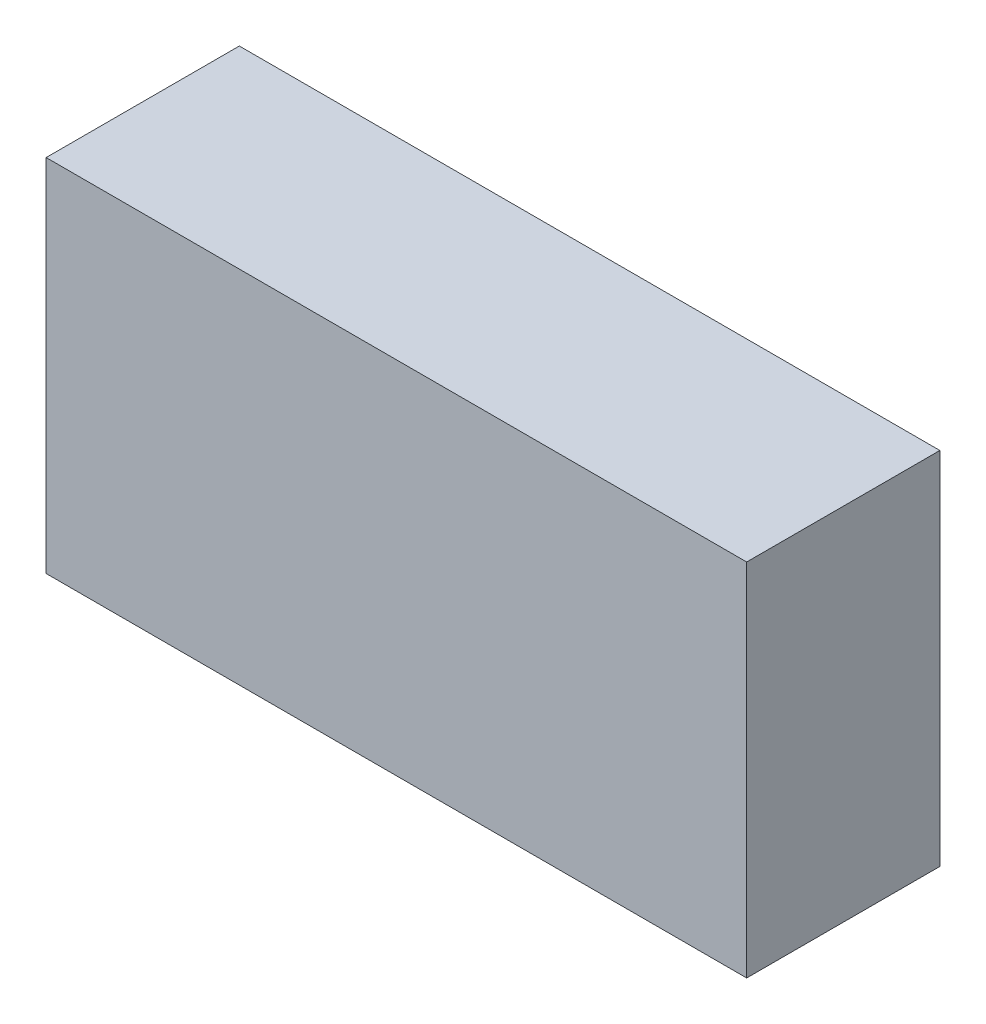
ISO-10303-21;
HEADER;
FILE_DESCRIPTION(('STEP AP214'),'2;1');
FILE_NAME('part.step','',(''),(''),'','','');
FILE_SCHEMA(('AUTOMOTIVE_DESIGN { 1 0 10303 214 1 1 1 1 }'));
ENDSEC;
DATA;
#1=APPLICATION_CONTEXT('core data for automotive mechanical design processes');
#2=APPLICATION_PROTOCOL_DEFINITION('international standard','automotive_design',2000,#1);
#3=PRODUCT_CONTEXT('',#1,'mechanical');
#4=PRODUCT('Part','Part','',(#3));
#5=PRODUCT_RELATED_PRODUCT_CATEGORY('part','',(#4));
#6=PRODUCT_DEFINITION_FORMATION('','',#4);
#7=PRODUCT_DEFINITION_CONTEXT('part definition',#1,'design');
#8=PRODUCT_DEFINITION('design','',#6,#7);
#9=PRODUCT_DEFINITION_SHAPE('','',#8);
#10=(LENGTH_UNIT() NAMED_UNIT(*) SI_UNIT(.MILLI.,.METRE.));
#11=(NAMED_UNIT(*) PLANE_ANGLE_UNIT() SI_UNIT($,.RADIAN.));
#12=(NAMED_UNIT(*) SI_UNIT($,.STERADIAN.) SOLID_ANGLE_UNIT());
#13=UNCERTAINTY_MEASURE_WITH_UNIT(LENGTH_MEASURE(1.E-05),#10,'distance_accuracy_value','');
#14=(GEOMETRIC_REPRESENTATION_CONTEXT(3) GLOBAL_UNCERTAINTY_ASSIGNED_CONTEXT((#13)) GLOBAL_UNIT_ASSIGNED_CONTEXT((#10,
#11,#12)) REPRESENTATION_CONTEXT('',''));
#15=CARTESIAN_POINT('',(0.,0.,0.));
#16=DIRECTION('',(0.,0.,1.));
#17=DIRECTION('',(1.,0.,0.));
#18=AXIS2_PLACEMENT_3D('',#15,#16,#17);
#19=CARTESIAN_POINT('',(0.87500206,-0.4499991,0.4826));
#20=DIRECTION('',(0.,0.,-1.));
#21=DIRECTION('',(0.,-1.,0.));
#22=AXIS2_PLACEMENT_3D('',#19,#20,#21);
#23=PLANE('',#22);
#24=DIRECTION('',(-2.82222789491105E-06,0.999999999996018,0.));
#25=VECTOR('',#24,1.);
#26=CARTESIAN_POINT('',(0.87500206,-0.4499991,0.4826));
#27=LINE('',#26,#25);
#28=CARTESIAN_POINT('',(0.87500206,-0.4499991,0.4826));
#29=VERTEX_POINT('',#28);
#30=CARTESIAN_POINT('',(0.87499952,0.4499991,0.4826));
#31=VERTEX_POINT('',#30);
#32=EDGE_CURVE('E87',#29,#31,#27,.T.);
#33=ORIENTED_EDGE('',*,*,#32,.T.);
#34=DIRECTION('',(-1.,0.,0.));
#35=VECTOR('',#34,1.);
#36=CARTESIAN_POINT('',(0.87499952,0.4499991,0.4826));
#37=LINE('',#36,#35);
#38=CARTESIAN_POINT('',(-0.87499952,0.4499991,0.4826));
#39=VERTEX_POINT('',#38);
#40=EDGE_CURVE('E86',#31,#39,#37,.T.);
#41=ORIENTED_EDGE('',*,*,#40,.T.);
#42=DIRECTION('',(2.82222789491105E-06,-0.999999999996018,0.));
#43=VECTOR('',#42,1.);
#44=CARTESIAN_POINT('',(-0.87499952,0.4499991,0.4826));
#45=LINE('',#44,#43);
#46=CARTESIAN_POINT('',(-0.87499698,-0.4499991,0.4826));
#47=VERTEX_POINT('',#46);
#48=EDGE_CURVE('E79',#39,#47,#45,.T.);
#49=ORIENTED_EDGE('',*,*,#48,.T.);
#50=DIRECTION('',(1.,0.,0.));
#51=VECTOR('',#50,1.);
#52=CARTESIAN_POINT('',(-0.87499698,-0.4499991,0.4826));
#53=LINE('',#52,#51);
#54=EDGE_CURVE('E11',#47,#29,#53,.T.);
#55=ORIENTED_EDGE('',*,*,#54,.T.);
#56=EDGE_LOOP('',(#33,#41,#49,#55));
#57=FACE_BOUND('',#56,.T.);
#58=ADVANCED_FACE('F17',(#57),#23,.F.);
#59=CARTESIAN_POINT('',(0.87500206,-0.4499991,0.));
#60=DIRECTION('',(0.,0.,-1.));
#61=DIRECTION('',(0.,-1.,0.));
#62=AXIS2_PLACEMENT_3D('',#59,#60,#61);
#63=PLANE('',#62);
#64=DIRECTION('',(-2.82222789491105E-06,0.999999999996018,0.));
#65=VECTOR('',#64,1.);
#66=CARTESIAN_POINT('',(0.87500206,-0.4499991,0.));
#67=LINE('',#66,#65);
#68=CARTESIAN_POINT('',(0.87500206,-0.4499991,0.));
#69=VERTEX_POINT('',#68);
#70=CARTESIAN_POINT('',(0.87499952,0.4499991,0.));
#71=VERTEX_POINT('',#70);
#72=EDGE_CURVE('E109',#69,#71,#67,.T.);
#73=ORIENTED_EDGE('',*,*,#72,.F.);
#74=DIRECTION('',(1.,0.,0.));
#75=VECTOR('',#74,1.);
#76=CARTESIAN_POINT('',(-0.87499698,-0.4499991,0.));
#77=LINE('',#76,#75);
#78=CARTESIAN_POINT('',(-0.87499698,-0.4499991,0.));
#79=VERTEX_POINT('',#78);
#80=EDGE_CURVE('E28',#79,#69,#77,.T.);
#81=ORIENTED_EDGE('',*,*,#80,.F.);
#82=DIRECTION('',(2.82222789491105E-06,-0.999999999996018,0.));
#83=VECTOR('',#82,1.);
#84=CARTESIAN_POINT('',(-0.87499952,0.4499991,0.));
#85=LINE('',#84,#83);
#86=CARTESIAN_POINT('',(-0.87499952,0.4499991,0.));
#87=VERTEX_POINT('',#86);
#88=EDGE_CURVE('E91',#87,#79,#85,.T.);
#89=ORIENTED_EDGE('',*,*,#88,.F.);
#90=DIRECTION('',(-1.,0.,0.));
#91=VECTOR('',#90,1.);
#92=CARTESIAN_POINT('',(0.87499952,0.4499991,0.));
#93=LINE('',#92,#91);
#94=EDGE_CURVE('E55',#71,#87,#93,.T.);
#95=ORIENTED_EDGE('',*,*,#94,.F.);
#96=EDGE_LOOP('',(#73,#81,#89,#95));
#97=FACE_BOUND('',#96,.T.);
#98=ADVANCED_FACE('F136',(#97),#63,.T.);
#99=CARTESIAN_POINT('',(-0.87499698,-0.4499991,0.));
#100=DIRECTION('',(0.,1.,0.));
#101=DIRECTION('',(1.,0.,0.));
#102=AXIS2_PLACEMENT_3D('',#99,#100,#101);
#103=PLANE('',#102);
#104=DIRECTION('',(0.,0.,1.));
#105=VECTOR('',#104,1.);
#106=CARTESIAN_POINT('',(-0.87499698,-0.4499991,0.));
#107=LINE('',#106,#105);
#108=EDGE_CURVE('E21',#79,#47,#107,.T.);
#109=ORIENTED_EDGE('',*,*,#108,.F.);
#110=ORIENTED_EDGE('',*,*,#80,.T.);
#111=DIRECTION('',(0.,0.,1.));
#112=VECTOR('',#111,1.);
#113=CARTESIAN_POINT('',(0.87500206,-0.4499991,0.));
#114=LINE('',#113,#112);
#115=EDGE_CURVE('E116',#69,#29,#114,.T.);
#116=ORIENTED_EDGE('',*,*,#115,.T.);
#117=ORIENTED_EDGE('',*,*,#54,.F.);
#118=EDGE_LOOP('',(#109,#110,#116,#117));
#119=FACE_BOUND('',#118,.T.);
#120=ADVANCED_FACE('F124',(#119),#103,.F.);
#121=CARTESIAN_POINT('',(-0.87499952,0.4499991,0.));
#122=DIRECTION('',(0.999999999996018,2.82222789491105E-06,0.));
#123=DIRECTION('',(0.,0.,-1.));
#124=AXIS2_PLACEMENT_3D('',#121,#122,#123);
#125=PLANE('',#124);
#126=DIRECTION('',(0.,0.,1.));
#127=VECTOR('',#126,1.);
#128=CARTESIAN_POINT('',(-0.87499952,0.4499991,0.));
#129=LINE('',#128,#127);
#130=EDGE_CURVE('E83',#87,#39,#129,.T.);
#131=ORIENTED_EDGE('',*,*,#130,.F.);
#132=ORIENTED_EDGE('',*,*,#88,.T.);
#133=ORIENTED_EDGE('',*,*,#108,.T.);
#134=ORIENTED_EDGE('',*,*,#48,.F.);
#135=EDGE_LOOP('',(#131,#132,#133,#134));
#136=FACE_BOUND('',#135,.T.);
#137=ADVANCED_FACE('F19',(#136),#125,.F.);
#138=CARTESIAN_POINT('',(0.87499952,0.4499991,0.));
#139=DIRECTION('',(0.,-1.,0.));
#140=DIRECTION('',(0.,0.,-1.));
#141=AXIS2_PLACEMENT_3D('',#138,#139,#140);
#142=PLANE('',#141);
#143=DIRECTION('',(0.,0.,1.));
#144=VECTOR('',#143,1.);
#145=CARTESIAN_POINT('',(0.87499952,0.4499991,0.));
#146=LINE('',#145,#144);
#147=EDGE_CURVE('E107',#71,#31,#146,.T.);
#148=ORIENTED_EDGE('',*,*,#147,.F.);
#149=ORIENTED_EDGE('',*,*,#94,.T.);
#150=ORIENTED_EDGE('',*,*,#130,.T.);
#151=ORIENTED_EDGE('',*,*,#40,.F.);
#152=EDGE_LOOP('',(#148,#149,#150,#151));
#153=FACE_BOUND('',#152,.T.);
#154=ADVANCED_FACE('F93',(#153),#142,.F.);
#155=CARTESIAN_POINT('',(0.87500206,-0.4499991,0.));
#156=DIRECTION('',(-0.999999999996018,-2.82222789491105E-06,0.));
#157=DIRECTION('',(-2.82222789491105E-06,0.999999999996018,0.));
#158=AXIS2_PLACEMENT_3D('',#155,#156,#157);
#159=PLANE('',#158);
#160=ORIENTED_EDGE('',*,*,#115,.F.);
#161=ORIENTED_EDGE('',*,*,#72,.T.);
#162=ORIENTED_EDGE('',*,*,#147,.T.);
#163=ORIENTED_EDGE('',*,*,#32,.F.);
#164=EDGE_LOOP('',(#160,#161,#162,#163));
#165=FACE_BOUND('',#164,.T.);
#166=ADVANCED_FACE('F125',(#165),#159,.F.);
#167=CLOSED_SHELL('',(#58,#98,#120,#137,#154,#166));
#168=MANIFOLD_SOLID_BREP('B1',#167);
#169=ADVANCED_BREP_SHAPE_REPRESENTATION('',(#18,#168),#14);
#170=SHAPE_DEFINITION_REPRESENTATION(#9,#169);
ENDSEC;
END-ISO-10303-21;
